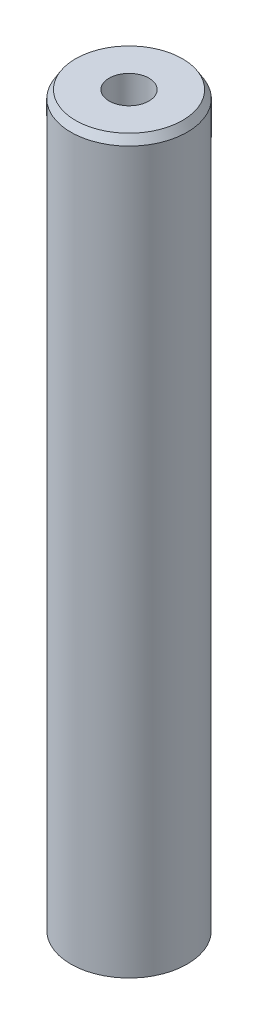
ISO-10303-21;
HEADER;
FILE_DESCRIPTION(('STEP AP214'),'2;1');
FILE_NAME('part.step','',(''),(''),'','','');
FILE_SCHEMA(('AUTOMOTIVE_DESIGN { 1 0 10303 214 1 1 1 1 }'));
ENDSEC;
DATA;
#1=APPLICATION_CONTEXT('core data for automotive mechanical design processes');
#2=APPLICATION_PROTOCOL_DEFINITION('international standard','automotive_design',2000,#1);
#3=PRODUCT_CONTEXT('',#1,'mechanical');
#4=PRODUCT('Part','Part','',(#3));
#5=PRODUCT_RELATED_PRODUCT_CATEGORY('part','',(#4));
#6=PRODUCT_DEFINITION_FORMATION('','',#4);
#7=PRODUCT_DEFINITION_CONTEXT('part definition',#1,'design');
#8=PRODUCT_DEFINITION('design','',#6,#7);
#9=PRODUCT_DEFINITION_SHAPE('','',#8);
#10=(LENGTH_UNIT() NAMED_UNIT(*) SI_UNIT(.MILLI.,.METRE.));
#11=(NAMED_UNIT(*) PLANE_ANGLE_UNIT() SI_UNIT($,.RADIAN.));
#12=(NAMED_UNIT(*) SI_UNIT($,.STERADIAN.) SOLID_ANGLE_UNIT());
#13=UNCERTAINTY_MEASURE_WITH_UNIT(LENGTH_MEASURE(1.E-05),#10,'distance_accuracy_value','');
#14=(GEOMETRIC_REPRESENTATION_CONTEXT(3) GLOBAL_UNCERTAINTY_ASSIGNED_CONTEXT((#13)) GLOBAL_UNIT_ASSIGNED_CONTEXT((#10,
#11,#12)) REPRESENTATION_CONTEXT('',''));
#15=CARTESIAN_POINT('',(0.,0.,0.));
#16=DIRECTION('',(0.,0.,1.));
#17=DIRECTION('',(1.,0.,0.));
#18=AXIS2_PLACEMENT_3D('',#15,#16,#17);
#19=CARTESIAN_POINT('',(0.,157.4516972796,0.));
#20=DIRECTION('',(0.,-1.,0.));
#21=DIRECTION('',(0.,0.,-1.));
#22=AXIS2_PLACEMENT_3D('',#19,#20,#21);
#23=CYLINDRICAL_SURFACE('',#22,12.5);
#24=CARTESIAN_POINT('',(0.,155.770938168877,0.));
#25=DIRECTION('',(0.,1.,0.));
#26=DIRECTION('',(0.,0.,1.));
#27=AXIS2_PLACEMENT_3D('',#24,#25,#26);
#28=CIRCLE('',#27,12.5);
#29=CARTESIAN_POINT('',(0.,155.770938168877,-12.5));
#30=VERTEX_POINT('',#29);
#31=EDGE_CURVE('E50',#30,#30,#28,.F.);
#32=CARTESIAN_POINT('',(0.,1.01527998270234,0.));
#33=DIRECTION('',(0.,1.,0.));
#34=DIRECTION('',(0.,0.,1.));
#35=AXIS2_PLACEMENT_3D('',#32,#33,#34);
#36=CIRCLE('',#35,12.5);
#37=CARTESIAN_POINT('',(0.,1.01527998270232,-12.5));
#38=VERTEX_POINT('',#37);
#39=EDGE_CURVE('E51',#38,#38,#36,.T.);
#40=CARTESIAN_POINT('',(0.,155.770938168877,-12.5));
#41=CARTESIAN_POINT('',(0.,154.158900062771,-12.5));
#42=CARTESIAN_POINT('',(0.,152.546861956665,-12.5));
#43=CARTESIAN_POINT('',(0.,149.322785744453,-12.5));
#44=CARTESIAN_POINT('',(0.,147.710747638347,-12.5));
#45=CARTESIAN_POINT('',(0.,144.486671426135,-12.5));
#46=CARTESIAN_POINT('',(0.,142.874633320029,-12.5));
#47=CARTESIAN_POINT('',(0.,139.650557107817,-12.5));
#48=CARTESIAN_POINT('',(0.,138.038519001711,-12.5));
#49=CARTESIAN_POINT('',(0.,134.814442789499,-12.5));
#50=CARTESIAN_POINT('',(0.,133.202404683393,-12.5));
#51=CARTESIAN_POINT('',(0.,129.978328471181,-12.5));
#52=CARTESIAN_POINT('',(0.,128.366290365075,-12.5));
#53=CARTESIAN_POINT('',(0.,125.142214152863,-12.5));
#54=CARTESIAN_POINT('',(0.,123.530176046757,-12.5));
#55=CARTESIAN_POINT('',(0.,120.306099834545,-12.5));
#56=CARTESIAN_POINT('',(0.,118.694061728439,-12.5));
#57=CARTESIAN_POINT('',(0.,115.469985516227,-12.5));
#58=CARTESIAN_POINT('',(0.,113.857947410121,-12.5));
#59=CARTESIAN_POINT('',(0.,110.633871197909,-12.5));
#60=CARTESIAN_POINT('',(0.,109.021833091804,-12.5));
#61=CARTESIAN_POINT('',(0.,105.797756879592,-12.5));
#62=CARTESIAN_POINT('',(0.,104.185718773486,-12.5));
#63=CARTESIAN_POINT('',(0.,100.961642561274,-12.5));
#64=CARTESIAN_POINT('',(0.,99.3496044551676,-12.5));
#65=CARTESIAN_POINT('',(0.,96.1255282429556,-12.5));
#66=CARTESIAN_POINT('',(0.,94.5134901368496,-12.5));
#67=CARTESIAN_POINT('',(0.,91.2894139246376,-12.5));
#68=CARTESIAN_POINT('',(0.,89.6773758185316,-12.5));
#69=CARTESIAN_POINT('',(0.,86.4532996063197,-12.5));
#70=CARTESIAN_POINT('',(0.,84.8412615002137,-12.5));
#71=CARTESIAN_POINT('',(0.,81.6171852880017,-12.5));
#72=CARTESIAN_POINT('',(0.,80.0051471818957,-12.5));
#73=CARTESIAN_POINT('',(0.,76.7810709696838,-12.5));
#74=CARTESIAN_POINT('',(0.,75.1690328635778,-12.5));
#75=CARTESIAN_POINT('',(0.,71.9449566513658,-12.5));
#76=CARTESIAN_POINT('',(0.,70.3329185452598,-12.5));
#77=CARTESIAN_POINT('',(0.,67.1088423330478,-12.5));
#78=CARTESIAN_POINT('',(0.,65.4968042269418,-12.5));
#79=CARTESIAN_POINT('',(0.,62.2727280147299,-12.5));
#80=CARTESIAN_POINT('',(0.,60.6606899086239,-12.5));
#81=CARTESIAN_POINT('',(0.,57.4366136964119,-12.5));
#82=CARTESIAN_POINT('',(0.,55.8245755903059,-12.5));
#83=CARTESIAN_POINT('',(0.,52.6004993780939,-12.5));
#84=CARTESIAN_POINT('',(0.,50.9884612719879,-12.5));
#85=CARTESIAN_POINT('',(0.,47.764385059776,-12.5));
#86=CARTESIAN_POINT('',(0.,46.15234695367,-12.5));
#87=CARTESIAN_POINT('',(0.,42.928270741458,-12.5));
#88=CARTESIAN_POINT('',(0.,41.316232635352,-12.5));
#89=CARTESIAN_POINT('',(0.,38.09215642314,-12.5));
#90=CARTESIAN_POINT('',(0.,36.480118317034,-12.5));
#91=CARTESIAN_POINT('',(0.,33.2560421048221,-12.5));
#92=CARTESIAN_POINT('',(0.,31.6440039987161,-12.5));
#93=CARTESIAN_POINT('',(0.,28.4199277865041,-12.5));
#94=CARTESIAN_POINT('',(0.,26.8078896803981,-12.5));
#95=CARTESIAN_POINT('',(0.,23.5838134681861,-12.5));
#96=CARTESIAN_POINT('',(0.,21.9717753620802,-12.5));
#97=CARTESIAN_POINT('',(0.,18.7476991498682,-12.5));
#98=CARTESIAN_POINT('',(0.,17.1356610437622,-12.5));
#99=CARTESIAN_POINT('',(0.,13.9115848315502,-12.5));
#100=CARTESIAN_POINT('',(0.,12.2995467254442,-12.5));
#101=CARTESIAN_POINT('',(0.,9.07547051323225,-12.5));
#102=CARTESIAN_POINT('',(0.,7.46343240712626,-12.5));
#103=CARTESIAN_POINT('',(0.,4.23935619491429,-12.5));
#104=CARTESIAN_POINT('',(0.,2.6273180888083,-12.5));
#105=CARTESIAN_POINT('',(0.,1.01527998270232,-12.5));
#106=B_SPLINE_CURVE_WITH_KNOTS('',3,(#40,#41,#42,#43,#44,#45,#46,#47,#48,#49,#50,#51,#52,#53,
#54,#55,#56,#57,#58,#59,#60,#61,#62,#63,#64,#65,#66,#67,#68,#69,#70,#71,#72,#73,#74,#75,#76,#77,
#78,#79,#80,#81,#82,#83,#84,#85,#86,#87,#88,#89,#90,#91,#92,#93,#94,#95,#96,#97,#98,#99,#100,
#101,#102,#103,#104,#105),.UNSPECIFIED.,.F.,.F.,(4,2,2,2,2,2,2,2,2,2,2,2,2,2,2,2,2,2,2,2,2,2,2,
2,2,2,2,2,2,2,2,2,4),(0.,4.83611431831796,9.67222863663592,14.5083429549539,19.3444572732718,
24.1805715915898,29.0166859099078,33.8528002282257,38.6889145465437,43.5250288648616,
48.3611431831796,53.1972575014976,58.0333718198155,62.8694861381335,67.7056004564515,
72.5417147747694,77.3778290930874,82.2139434114054,87.0500577297233,91.8861720480413,
96.7222863663593,101.558400684677,106.394515002995,111.230629321313,116.066743639631,
120.902857957949,125.738972276267,130.575086594585,135.411200912903,140.247315231221,
145.083429549539,149.919543867857,154.755658186175),.UNSPECIFIED.);
#107=EDGE_CURVE('BSEAM39',#30,#38,#106,.T.);
#108=ORIENTED_EDGE('',*,*,#31,.T.);
#109=ORIENTED_EDGE('',*,*,#39,.T.);
#110=ORIENTED_EDGE('',*,*,#107,.T.);
#111=ORIENTED_EDGE('',*,*,#107,.F.);
#112=EDGE_LOOP('',(#108,#110,#109,#111));
#113=FACE_BOUND('',#112,.T.);
#114=ADVANCED_FACE('F39',(#113),#23,.T.);
#115=CARTESIAN_POINT('',(0.,157.4516972796,0.));
#116=DIRECTION('',(0.,1.,0.));
#117=DIRECTION('',(0.,0.,1.));
#118=AXIS2_PLACEMENT_3D('',#115,#116,#117);
#119=PLANE('',#118);
#120=CARTESIAN_POINT('',(0.,157.4516972796,0.));
#121=DIRECTION('',(0.,1.,0.));
#122=DIRECTION('',(0.,0.,1.));
#123=AXIS2_PLACEMENT_3D('',#120,#121,#122);
#124=CIRCLE('',#123,11.4847200172978);
#125=CARTESIAN_POINT('',(0.,157.4516972796,11.4847200172978));
#126=VERTEX_POINT('',#125);
#127=EDGE_CURVE('E54',#126,#126,#124,.T.);
#128=ORIENTED_EDGE('',*,*,#127,.T.);
#129=EDGE_LOOP('',(#128));
#130=FACE_BOUND('',#129,.T.);
#131=CARTESIAN_POINT('',(0.,157.4516972796,0.));
#132=DIRECTION('',(0.,1.,0.));
#133=DIRECTION('',(0.,0.,1.));
#134=AXIS2_PLACEMENT_3D('',#131,#132,#133);
#135=CIRCLE('',#134,4.2743838627259);
#136=CARTESIAN_POINT('',(0.,157.4516972796,-4.2743838627259));
#137=VERTEX_POINT('',#136);
#138=EDGE_CURVE('E58',#137,#137,#135,.T.);
#139=ORIENTED_EDGE('',*,*,#138,.F.);
#140=EDGE_LOOP('',(#139));
#141=FACE_BOUND('',#140,.T.);
#142=ADVANCED_FACE('F69',(#130,#141),#119,.T.);
#143=CARTESIAN_POINT('',(0.,0.,0.));
#144=DIRECTION('',(0.,1.,0.));
#145=DIRECTION('',(0.,0.,1.));
#146=AXIS2_PLACEMENT_3D('',#143,#144,#145);
#147=PLANE('',#146);
#148=CARTESIAN_POINT('',(0.,0.,0.));
#149=DIRECTION('',(0.,1.,0.));
#150=DIRECTION('',(0.,0.,1.));
#151=AXIS2_PLACEMENT_3D('',#148,#149,#150);
#152=CIRCLE('',#151,10.8192408892767);
#153=CARTESIAN_POINT('',(0.,0.,10.8192408892767));
#154=VERTEX_POINT('',#153);
#155=EDGE_CURVE('E10',#154,#154,#152,.F.);
#156=ORIENTED_EDGE('',*,*,#155,.T.);
#157=EDGE_LOOP('',(#156));
#158=FACE_BOUND('',#157,.T.);
#159=CARTESIAN_POINT('',(0.,0.,0.));
#160=DIRECTION('',(0.,1.,0.));
#161=DIRECTION('',(0.,0.,1.));
#162=AXIS2_PLACEMENT_3D('',#159,#160,#161);
#163=CIRCLE('',#162,4.2743838627259);
#164=CARTESIAN_POINT('',(0.,0.,-4.2743838627259));
#165=VERTEX_POINT('',#164);
#166=EDGE_CURVE('E63',#165,#165,#163,.T.);
#167=ORIENTED_EDGE('',*,*,#166,.T.);
#168=EDGE_LOOP('',(#167));
#169=FACE_BOUND('',#168,.T.);
#170=ADVANCED_FACE('F75',(#158,#169),#147,.F.);
#171=CARTESIAN_POINT('',(0.,157.4516972796,0.));
#172=DIRECTION('',(0.,-1.,0.));
#173=DIRECTION('',(0.,0.,-1.));
#174=AXIS2_PLACEMENT_3D('',#171,#172,#173);
#175=CYLINDRICAL_SURFACE('',#174,4.2743838627259);
#176=CARTESIAN_POINT('',(0.,157.4516972796,-4.2743838627259));
#177=CARTESIAN_POINT('',(0.,155.811575432938,-4.2743838627259));
#178=CARTESIAN_POINT('',(0.,154.171453586275,-4.2743838627259));
#179=CARTESIAN_POINT('',(0.,150.89120989295,-4.2743838627259));
#180=CARTESIAN_POINT('',(0.,149.251088046288,-4.2743838627259));
#181=CARTESIAN_POINT('',(0.,145.970844352963,-4.2743838627259));
#182=CARTESIAN_POINT('',(0.,144.3307225063,-4.2743838627259));
#183=CARTESIAN_POINT('',(0.,141.050478812975,-4.2743838627259));
#184=CARTESIAN_POINT('',(0.,139.410356966313,-4.2743838627259));
#185=CARTESIAN_POINT('',(0.,136.130113272988,-4.2743838627259));
#186=CARTESIAN_POINT('',(0.,134.489991426325,-4.2743838627259));
#187=CARTESIAN_POINT('',(0.,131.209747733,-4.2743838627259));
#188=CARTESIAN_POINT('',(0.,129.569625886338,-4.2743838627259));
#189=CARTESIAN_POINT('',(0.,126.289382193013,-4.2743838627259));
#190=CARTESIAN_POINT('',(0.,124.64926034635,-4.2743838627259));
#191=CARTESIAN_POINT('',(0.,121.369016653025,-4.2743838627259));
#192=CARTESIAN_POINT('',(0.,119.728894806363,-4.2743838627259));
#193=CARTESIAN_POINT('',(0.,116.448651113038,-4.2743838627259));
#194=CARTESIAN_POINT('',(0.,114.808529266375,-4.2743838627259));
#195=CARTESIAN_POINT('',(0.,111.52828557305,-4.2743838627259));
#196=CARTESIAN_POINT('',(0.,109.888163726388,-4.2743838627259));
#197=CARTESIAN_POINT('',(0.,106.607920033063,-4.2743838627259));
#198=CARTESIAN_POINT('',(0.,104.9677981864,-4.2743838627259));
#199=CARTESIAN_POINT('',(0.,101.687554493075,-4.2743838627259));
#200=CARTESIAN_POINT('',(0.,100.047432646413,-4.2743838627259));
#201=CARTESIAN_POINT('',(0.,96.7671889530876,-4.2743838627259));
#202=CARTESIAN_POINT('',(0.,95.1270671064251,-4.2743838627259));
#203=CARTESIAN_POINT('',(0.,91.8468234131001,-4.2743838627259));
#204=CARTESIAN_POINT('',(0.,90.2067015664376,-4.2743838627259));
#205=CARTESIAN_POINT('',(0.,86.9264578731126,-4.2743838627259));
#206=CARTESIAN_POINT('',(0.,85.2863360264501,-4.2743838627259));
#207=CARTESIAN_POINT('',(0.,82.0060923331251,-4.2743838627259));
#208=CARTESIAN_POINT('',(0.,80.3659704864626,-4.2743838627259));
#209=CARTESIAN_POINT('',(0.,77.0857267931376,-4.2743838627259));
#210=CARTESIAN_POINT('',(0.,75.4456049464751,-4.2743838627259));
#211=CARTESIAN_POINT('',(0.,72.1653612531501,-4.2743838627259));
#212=CARTESIAN_POINT('',(0.,70.5252394064876,-4.2743838627259));
#213=CARTESIAN_POINT('',(0.,67.2449957131626,-4.2743838627259));
#214=CARTESIAN_POINT('',(0.,65.6048738665001,-4.2743838627259));
#215=CARTESIAN_POINT('',(0.,62.3246301731751,-4.2743838627259));
#216=CARTESIAN_POINT('',(0.,60.6845083265126,-4.2743838627259));
#217=CARTESIAN_POINT('',(0.,57.4042646331875,-4.2743838627259));
#218=CARTESIAN_POINT('',(0.,55.764142786525,-4.2743838627259));
#219=CARTESIAN_POINT('',(0.,52.4838990932,-4.2743838627259));
#220=CARTESIAN_POINT('',(0.,50.8437772465375,-4.2743838627259));
#221=CARTESIAN_POINT('',(0.,47.5635335532125,-4.2743838627259));
#222=CARTESIAN_POINT('',(0.,45.92341170655,-4.2743838627259));
#223=CARTESIAN_POINT('',(0.,42.643168013225,-4.2743838627259));
#224=CARTESIAN_POINT('',(0.,41.0030461665625,-4.2743838627259));
#225=CARTESIAN_POINT('',(0.,37.7228024732375,-4.2743838627259));
#226=CARTESIAN_POINT('',(0.,36.082680626575,-4.2743838627259));
#227=CARTESIAN_POINT('',(0.,32.80243693325,-4.2743838627259));
#228=CARTESIAN_POINT('',(0.,31.1623150865875,-4.2743838627259));
#229=CARTESIAN_POINT('',(0.,27.8820713932625,-4.2743838627259));
#230=CARTESIAN_POINT('',(0.,26.2419495466,-4.2743838627259));
#231=CARTESIAN_POINT('',(0.,22.961705853275,-4.2743838627259));
#232=CARTESIAN_POINT('',(0.,21.3215840066125,-4.2743838627259));
#233=CARTESIAN_POINT('',(0.,18.0413403132875,-4.2743838627259));
#234=CARTESIAN_POINT('',(0.,16.401218466625,-4.2743838627259));
#235=CARTESIAN_POINT('',(0.,13.1209747733,-4.2743838627259));
#236=CARTESIAN_POINT('',(0.,11.4808529266375,-4.2743838627259));
#237=CARTESIAN_POINT('',(0.,8.20060923331249,-4.2743838627259));
#238=CARTESIAN_POINT('',(0.,6.56048738664998,-4.2743838627259));
#239=CARTESIAN_POINT('',(0.,3.28024369332498,-4.2743838627259));
#240=CARTESIAN_POINT('',(0.,1.64012184666248,-4.2743838627259));
#241=CARTESIAN_POINT('',(0.,0.,-4.2743838627259));
#242=B_SPLINE_CURVE_WITH_KNOTS('',3,(#176,#177,#178,#179,#180,#181,#182,#183,#184,#185,#186,
#187,#188,#189,#190,#191,#192,#193,#194,#195,#196,#197,#198,#199,#200,#201,#202,#203,#204,#205,
#206,#207,#208,#209,#210,#211,#212,#213,#214,#215,#216,#217,#218,#219,#220,#221,#222,#223,#224,
#225,#226,#227,#228,#229,#230,#231,#232,#233,#234,#235,#236,#237,#238,#239,#240,#241),
.UNSPECIFIED.,.F.,.F.,(4,2,2,2,2,2,2,2,2,2,2,2,2,2,2,2,2,2,2,2,2,2,2,2,2,2,2,2,2,2,2,2,4),(0.,
4.92036553998751,9.84073107997502,14.7610966199625,19.68146215995,24.6018276999375,
29.5221932399251,34.4425587799126,39.3629243199001,44.2832898598876,49.2036553998751,
54.1240209398626,59.0443864798501,63.9647520198376,68.8851175598251,73.8054830998126,
78.7258486398001,83.6462141797876,88.5665797197752,93.4869452597627,98.4073107997502,
103.327676339738,108.248041879725,113.168407419713,118.0887729597,123.009138499688,
127.929504039675,132.849869579663,137.77023511965,142.690600659638,147.610966199625,
152.531331739613,157.4516972796),.UNSPECIFIED.);
#243=EDGE_CURVE('BSEAM70',#137,#165,#242,.T.);
#244=ORIENTED_EDGE('',*,*,#138,.T.);
#245=ORIENTED_EDGE('',*,*,#166,.F.);
#246=ORIENTED_EDGE('',*,*,#243,.T.);
#247=ORIENTED_EDGE('',*,*,#243,.F.);
#248=EDGE_LOOP('',(#244,#246,#245,#247));
#249=FACE_BOUND('',#248,.T.);
#250=ADVANCED_FACE('F70',(#249),#175,.F.);
#251=CARTESIAN_POINT('',(0.,157.4516972796,0.));
#252=DIRECTION('',(0.,-1.,0.));
#253=DIRECTION('',(0.,0.,-1.));
#254=AXIS2_PLACEMENT_3D('',#251,#252,#253);
#255=CONICAL_SURFACE('',#254,11.4847200172978,0.543399724428293);
#256=ORIENTED_EDGE('',*,*,#31,.F.);
#257=EDGE_LOOP('',(#256));
#258=FACE_BOUND('',#257,.T.);
#259=ORIENTED_EDGE('',*,*,#127,.F.);
#260=EDGE_LOOP('',(#259));
#261=FACE_BOUND('',#260,.T.);
#262=ADVANCED_FACE('F81',(#258,#261),#255,.T.);
#263=CARTESIAN_POINT('',(0.,1.01527998270234,0.));
#264=DIRECTION('',(0.,1.,0.));
#265=DIRECTION('',(0.,0.,1.));
#266=AXIS2_PLACEMENT_3D('',#263,#264,#265);
#267=CONICAL_SURFACE('',#266,12.5,1.0273966023666);
#268=ORIENTED_EDGE('',*,*,#155,.F.);
#269=EDGE_LOOP('',(#268));
#270=FACE_BOUND('',#269,.T.);
#271=ORIENTED_EDGE('',*,*,#39,.F.);
#272=EDGE_LOOP('',(#271));
#273=FACE_BOUND('',#272,.T.);
#274=ADVANCED_FACE('F45',(#270,#273),#267,.T.);
#275=CLOSED_SHELL('',(#114,#142,#170,#250,#262,#274));
#276=MANIFOLD_SOLID_BREP('B2',#275);
#277=ADVANCED_BREP_SHAPE_REPRESENTATION('',(#18,#276),#14);
#278=SHAPE_DEFINITION_REPRESENTATION(#9,#277);
ENDSEC;
END-ISO-10303-21;
